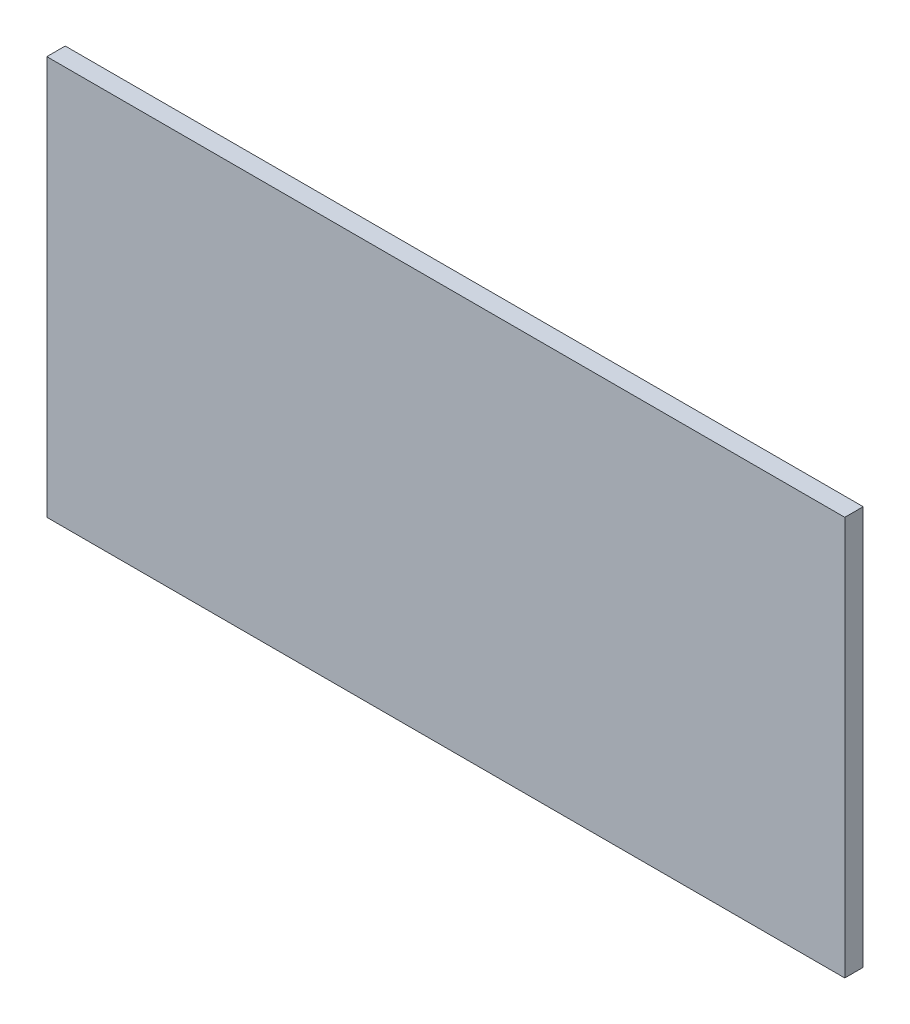
ISO-10303-21;
HEADER;
FILE_DESCRIPTION(('STEP AP214'),'2;1');
FILE_NAME('part.step','',(''),(''),'','','');
FILE_SCHEMA(('AUTOMOTIVE_DESIGN { 1 0 10303 214 1 1 1 1 }'));
ENDSEC;
DATA;
#1=APPLICATION_CONTEXT('core data for automotive mechanical design processes');
#2=APPLICATION_PROTOCOL_DEFINITION('international standard','automotive_design',2000,#1);
#3=PRODUCT_CONTEXT('',#1,'mechanical');
#4=PRODUCT('Part','Part','',(#3));
#5=PRODUCT_RELATED_PRODUCT_CATEGORY('part','',(#4));
#6=PRODUCT_DEFINITION_FORMATION('','',#4);
#7=PRODUCT_DEFINITION_CONTEXT('part definition',#1,'design');
#8=PRODUCT_DEFINITION('design','',#6,#7);
#9=PRODUCT_DEFINITION_SHAPE('','',#8);
#10=(LENGTH_UNIT() NAMED_UNIT(*) SI_UNIT(.MILLI.,.METRE.));
#11=(NAMED_UNIT(*) PLANE_ANGLE_UNIT() SI_UNIT($,.RADIAN.));
#12=(NAMED_UNIT(*) SI_UNIT($,.STERADIAN.) SOLID_ANGLE_UNIT());
#13=UNCERTAINTY_MEASURE_WITH_UNIT(LENGTH_MEASURE(1.E-05),#10,'distance_accuracy_value','');
#14=(GEOMETRIC_REPRESENTATION_CONTEXT(3) GLOBAL_UNCERTAINTY_ASSIGNED_CONTEXT((#13)) GLOBAL_UNIT_ASSIGNED_CONTEXT((#10,
#11,#12)) REPRESENTATION_CONTEXT('',''));
#15=CARTESIAN_POINT('',(0.,0.,0.));
#16=DIRECTION('',(0.,0.,1.));
#17=DIRECTION('',(1.,0.,0.));
#18=AXIS2_PLACEMENT_3D('',#15,#16,#17);
#19=CARTESIAN_POINT('',(65.,32.5,3.));
#20=DIRECTION('',(-1.,0.,0.));
#21=DIRECTION('',(0.,-1.,0.));
#22=AXIS2_PLACEMENT_3D('',#19,#20,#21);
#23=PLANE('',#22);
#24=DIRECTION('',(0.,1.,0.));
#25=VECTOR('',#24,1.);
#26=CARTESIAN_POINT('',(65.,32.5,0.));
#27=LINE('',#26,#25);
#28=CARTESIAN_POINT('',(65.,-32.5,0.));
#29=VERTEX_POINT('',#28);
#30=CARTESIAN_POINT('',(65.,32.5,0.));
#31=VERTEX_POINT('',#30);
#32=EDGE_CURVE('E107',#29,#31,#27,.T.);
#33=ORIENTED_EDGE('',*,*,#32,.T.);
#34=DIRECTION('',(0.,0.,-1.));
#35=VECTOR('',#34,1.);
#36=CARTESIAN_POINT('',(65.,32.5,3.));
#37=LINE('',#36,#35);
#38=CARTESIAN_POINT('',(65.,32.5,3.));
#39=VERTEX_POINT('',#38);
#40=EDGE_CURVE('E11',#39,#31,#37,.T.);
#41=ORIENTED_EDGE('',*,*,#40,.F.);
#42=DIRECTION('',(0.,1.,0.));
#43=VECTOR('',#42,1.);
#44=CARTESIAN_POINT('',(65.,32.5,3.));
#45=LINE('',#44,#43);
#46=CARTESIAN_POINT('',(65.,-32.5,3.));
#47=VERTEX_POINT('',#46);
#48=EDGE_CURVE('E91',#47,#39,#45,.T.);
#49=ORIENTED_EDGE('',*,*,#48,.F.);
#50=DIRECTION('',(0.,0.,-1.));
#51=VECTOR('',#50,1.);
#52=CARTESIAN_POINT('',(65.,-32.5,3.));
#53=LINE('',#52,#51);
#54=EDGE_CURVE('E103',#47,#29,#53,.T.);
#55=ORIENTED_EDGE('',*,*,#54,.T.);
#56=EDGE_LOOP('',(#33,#41,#49,#55));
#57=FACE_BOUND('',#56,.T.);
#58=ADVANCED_FACE('F39',(#57),#23,.F.);
#59=CARTESIAN_POINT('',(-65.,32.5,3.));
#60=DIRECTION('',(0.,-1.,0.));
#61=DIRECTION('',(0.,0.,-1.));
#62=AXIS2_PLACEMENT_3D('',#59,#60,#61);
#63=PLANE('',#62);
#64=DIRECTION('',(-1.,0.,0.));
#65=VECTOR('',#64,1.);
#66=CARTESIAN_POINT('',(-65.,32.5,0.));
#67=LINE('',#66,#65);
#68=CARTESIAN_POINT('',(-65.,32.5,0.));
#69=VERTEX_POINT('',#68);
#70=EDGE_CURVE('E96',#31,#69,#67,.T.);
#71=ORIENTED_EDGE('',*,*,#70,.T.);
#72=DIRECTION('',(0.,0.,-1.));
#73=VECTOR('',#72,1.);
#74=CARTESIAN_POINT('',(-65.,32.5,3.));
#75=LINE('',#74,#73);
#76=CARTESIAN_POINT('',(-65.,32.5,3.));
#77=VERTEX_POINT('',#76);
#78=EDGE_CURVE('E48',#77,#69,#75,.T.);
#79=ORIENTED_EDGE('',*,*,#78,.F.);
#80=DIRECTION('',(-1.,0.,0.));
#81=VECTOR('',#80,1.);
#82=CARTESIAN_POINT('',(-65.,32.5,3.));
#83=LINE('',#82,#81);
#84=EDGE_CURVE('E86',#39,#77,#83,.T.);
#85=ORIENTED_EDGE('',*,*,#84,.F.);
#86=ORIENTED_EDGE('',*,*,#40,.T.);
#87=EDGE_LOOP('',(#71,#79,#85,#86));
#88=FACE_BOUND('',#87,.T.);
#89=ADVANCED_FACE('F95',(#88),#63,.F.);
#90=CARTESIAN_POINT('',(-65.,32.5,3.));
#91=DIRECTION('',(1.,0.,0.));
#92=DIRECTION('',(0.,1.,0.));
#93=AXIS2_PLACEMENT_3D('',#90,#91,#92);
#94=PLANE('',#93);
#95=DIRECTION('',(0.,-1.,0.));
#96=VECTOR('',#95,1.);
#97=CARTESIAN_POINT('',(-65.,32.5,0.));
#98=LINE('',#97,#96);
#99=CARTESIAN_POINT('',(-65.,-32.5,0.));
#100=VERTEX_POINT('',#99);
#101=EDGE_CURVE('E73',#69,#100,#98,.T.);
#102=ORIENTED_EDGE('',*,*,#101,.T.);
#103=DIRECTION('',(0.,0.,-1.));
#104=VECTOR('',#103,1.);
#105=CARTESIAN_POINT('',(-65.,-32.5,3.));
#106=LINE('',#105,#104);
#107=CARTESIAN_POINT('',(-65.,-32.5,3.));
#108=VERTEX_POINT('',#107);
#109=EDGE_CURVE('E98',#108,#100,#106,.T.);
#110=ORIENTED_EDGE('',*,*,#109,.F.);
#111=DIRECTION('',(0.,-1.,0.));
#112=VECTOR('',#111,1.);
#113=CARTESIAN_POINT('',(-65.,32.5,3.));
#114=LINE('',#113,#112);
#115=EDGE_CURVE('E89',#77,#108,#114,.T.);
#116=ORIENTED_EDGE('',*,*,#115,.F.);
#117=ORIENTED_EDGE('',*,*,#78,.T.);
#118=EDGE_LOOP('',(#102,#110,#116,#117));
#119=FACE_BOUND('',#118,.T.);
#120=ADVANCED_FACE('F99',(#119),#94,.F.);
#121=CARTESIAN_POINT('',(-65.,-32.5,3.));
#122=DIRECTION('',(0.,1.,0.));
#123=DIRECTION('',(0.,0.,1.));
#124=AXIS2_PLACEMENT_3D('',#121,#122,#123);
#125=PLANE('',#124);
#126=DIRECTION('',(1.,0.,0.));
#127=VECTOR('',#126,1.);
#128=CARTESIAN_POINT('',(-65.,-32.5,0.));
#129=LINE('',#128,#127);
#130=EDGE_CURVE('E79',#100,#29,#129,.T.);
#131=ORIENTED_EDGE('',*,*,#130,.T.);
#132=ORIENTED_EDGE('',*,*,#54,.F.);
#133=DIRECTION('',(1.,0.,0.));
#134=VECTOR('',#133,1.);
#135=CARTESIAN_POINT('',(-65.,-32.5,3.));
#136=LINE('',#135,#134);
#137=EDGE_CURVE('E56',#108,#47,#136,.T.);
#138=ORIENTED_EDGE('',*,*,#137,.F.);
#139=ORIENTED_EDGE('',*,*,#109,.T.);
#140=EDGE_LOOP('',(#131,#132,#138,#139));
#141=FACE_BOUND('',#140,.T.);
#142=ADVANCED_FACE('F120',(#141),#125,.F.);
#143=CARTESIAN_POINT('',(0.,0.,3.));
#144=DIRECTION('',(0.,0.,1.));
#145=DIRECTION('',(1.,0.,0.));
#146=AXIS2_PLACEMENT_3D('',#143,#144,#145);
#147=PLANE('',#146);
#148=ORIENTED_EDGE('',*,*,#48,.T.);
#149=ORIENTED_EDGE('',*,*,#84,.T.);
#150=ORIENTED_EDGE('',*,*,#115,.T.);
#151=ORIENTED_EDGE('',*,*,#137,.T.);
#152=EDGE_LOOP('',(#148,#149,#150,#151));
#153=FACE_BOUND('',#152,.T.);
#154=ADVANCED_FACE('F87',(#153),#147,.T.);
#155=CARTESIAN_POINT('',(0.,0.,0.));
#156=DIRECTION('',(0.,0.,1.));
#157=DIRECTION('',(1.,0.,0.));
#158=AXIS2_PLACEMENT_3D('',#155,#156,#157);
#159=PLANE('',#158);
#160=ORIENTED_EDGE('',*,*,#32,.F.);
#161=ORIENTED_EDGE('',*,*,#130,.F.);
#162=ORIENTED_EDGE('',*,*,#101,.F.);
#163=ORIENTED_EDGE('',*,*,#70,.F.);
#164=EDGE_LOOP('',(#160,#161,#162,#163));
#165=FACE_BOUND('',#164,.T.);
#166=ADVANCED_FACE('F123',(#165),#159,.F.);
#167=CLOSED_SHELL('',(#58,#89,#120,#142,#154,#166));
#168=MANIFOLD_SOLID_BREP('B2',#167);
#169=ADVANCED_BREP_SHAPE_REPRESENTATION('',(#18,#168),#14);
#170=SHAPE_DEFINITION_REPRESENTATION(#9,#169);
ENDSEC;
END-ISO-10303-21;
